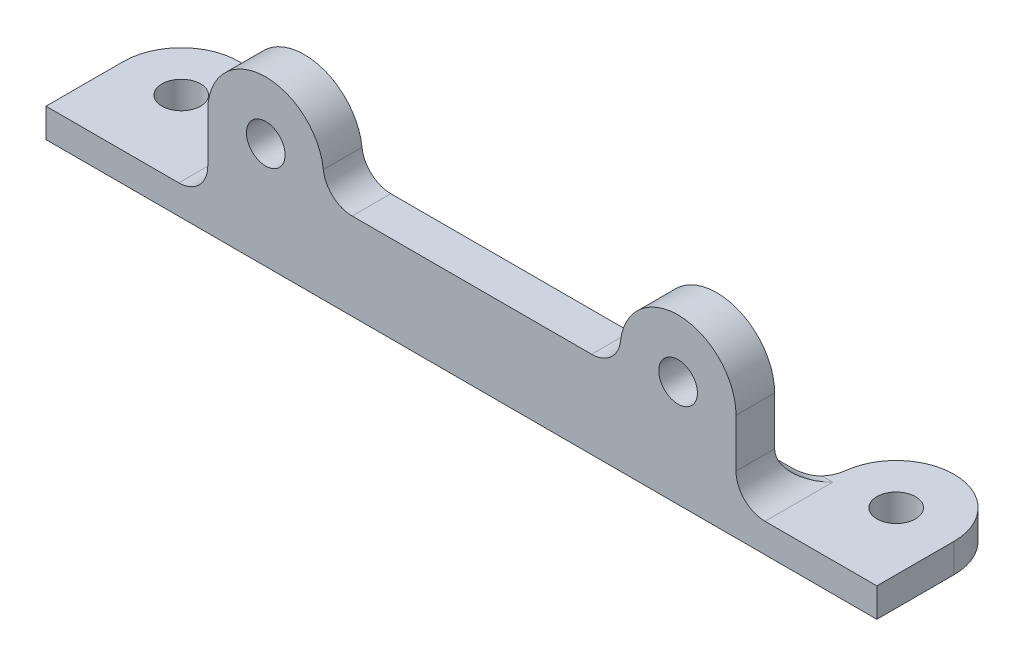
ISO-10303-21;
HEADER;
FILE_DESCRIPTION(('STEP AP214'),'2;1');
FILE_NAME('part.step','',(''),(''),'','','');
FILE_SCHEMA(('AUTOMOTIVE_DESIGN { 1 0 10303 214 1 1 1 1 }'));
ENDSEC;
DATA;
#1=APPLICATION_CONTEXT('core data for automotive mechanical design processes');
#2=APPLICATION_PROTOCOL_DEFINITION('international standard','automotive_design',2000,#1);
#3=PRODUCT_CONTEXT('',#1,'mechanical');
#4=PRODUCT('Part','Part','',(#3));
#5=PRODUCT_RELATED_PRODUCT_CATEGORY('part','',(#4));
#6=PRODUCT_DEFINITION_FORMATION('','',#4);
#7=PRODUCT_DEFINITION_CONTEXT('part definition',#1,'design');
#8=PRODUCT_DEFINITION('design','',#6,#7);
#9=PRODUCT_DEFINITION_SHAPE('','',#8);
#10=(LENGTH_UNIT() NAMED_UNIT(*) SI_UNIT(.MILLI.,.METRE.));
#11=(NAMED_UNIT(*) PLANE_ANGLE_UNIT() SI_UNIT($,.RADIAN.));
#12=(NAMED_UNIT(*) SI_UNIT($,.STERADIAN.) SOLID_ANGLE_UNIT());
#13=UNCERTAINTY_MEASURE_WITH_UNIT(LENGTH_MEASURE(1.E-05),#10,'distance_accuracy_value','');
#14=(GEOMETRIC_REPRESENTATION_CONTEXT(3) GLOBAL_UNCERTAINTY_ASSIGNED_CONTEXT((#13)) GLOBAL_UNIT_ASSIGNED_CONTEXT((#10,
#11,#12)) REPRESENTATION_CONTEXT('',''));
#15=CARTESIAN_POINT('',(0.,0.,0.));
#16=DIRECTION('',(0.,0.,1.));
#17=DIRECTION('',(1.,0.,0.));
#18=AXIS2_PLACEMENT_3D('',#15,#16,#17);
#19=CARTESIAN_POINT('',(0.,6.,1.));
#20=DIRECTION('',(-1.,0.,0.));
#21=DIRECTION('',(0.,0.,1.));
#22=AXIS2_PLACEMENT_3D('',#19,#20,#21);
#23=CYLINDRICAL_SURFACE('',#22,3.);
#24=DIRECTION('',(-1.,0.,0.));
#25=VECTOR('',#24,1.);
#26=CARTESIAN_POINT('',(0.,3.,1.));
#27=LINE('',#26,#25);
#28=CARTESIAN_POINT('',(67.2917960675006,3.,1.));
#29=VERTEX_POINT('',#28);
#30=CARTESIAN_POINT('',(68.4242365283552,3.,1.));
#31=VERTEX_POINT('',#30);
#32=EDGE_CURVE('E291',#29,#31,#27,.F.);
#33=ORIENTED_EDGE('',*,*,#32,.F.);
#34=CARTESIAN_POINT('',(67.2917960675006,3.,1.));
#35=CARTESIAN_POINT('',(67.2364548727916,3.00000044074267,1.06188946641905));
#36=CARTESIAN_POINT('',(67.178556455534,3.00191474656417,1.12143671954915));
#37=CARTESIAN_POINT('',(67.0581660588117,3.00870672524174,1.23541738653473));
#38=CARTESIAN_POINT('',(66.9956776693219,3.01358210338594,1.28985472269132));
#39=CARTESIAN_POINT('',(66.8665387317685,3.02543474745615,1.39328501088777));
#40=CARTESIAN_POINT('',(66.7998880326978,3.03241208967588,1.44227776522055));
#41=CARTESIAN_POINT('',(66.6628826879758,3.04763589975376,1.53453756703246));
#42=CARTESIAN_POINT('',(66.592527406496,3.05588258594341,1.57780362711487));
#43=CARTESIAN_POINT('',(66.3768124377782,3.0812862899577,1.69848479150016));
#44=CARTESIAN_POINT('',(66.2264638343451,3.099146164623,1.76705411985068));
#45=CARTESIAN_POINT('',(65.9164317708158,3.13094326752467,1.87858614767298));
#46=CARTESIAN_POINT('',(65.7567658910774,3.14488761207814,1.9215954624267));
#47=CARTESIAN_POINT('',(65.5057816241248,3.16021704010705,1.96742376632034));
#48=CARTESIAN_POINT('',(65.4162688378073,3.16442996175495,1.97962310877027));
#49=CARTESIAN_POINT('',(65.2364293858268,3.17012665435029,1.99591511378764));
#50=CARTESIAN_POINT('',(65.1461027653807,3.17161057599374,2.00000822398407));
#51=CARTESIAN_POINT('',(65.0557280900008,3.17157287525381,2.));
#52=B_SPLINE_CURVE_WITH_KNOTS('',3,(#34,#35,#36,#37,#38,#39,#40,#41,#42,#43,#44,#45,#46,#47,#48,
#49,#50,#51),.UNSPECIFIED.,.F.,.F.,(4,2,2,2,2,2,2,2,4),(0.,0.248917701740481,0.497642747979507,
0.746376823129656,0.995153729300597,1.49141381632357,1.98676604521497,2.25770982706082,
2.52863864687878),.UNSPECIFIED.);
#53=CARTESIAN_POINT('',(65.0557280900008,3.17157287525381,2.));
#54=VERTEX_POINT('',#53);
#55=EDGE_CURVE('E330',#29,#54,#52,.T.);
#56=ORIENTED_EDGE('',*,*,#55,.T.);
#57=DIRECTION('',(-1.,0.,0.));
#58=VECTOR('',#57,1.);
#59=CARTESIAN_POINT('',(8.74596283490439,3.17157287525381,2.));
#60=LINE('',#59,#58);
#61=CARTESIAN_POINT('',(8.94427190999916,3.17157287525381,2.));
#62=VERTEX_POINT('',#61);
#63=EDGE_CURVE('E314',#62,#54,#60,.F.);
#64=ORIENTED_EDGE('',*,*,#63,.F.);
#65=CARTESIAN_POINT('',(8.94427190999916,3.17157287525381,2.));
#66=CARTESIAN_POINT('',(8.91000259856074,3.17157146458319,1.9999994860485));
#67=CARTESIAN_POINT('',(8.87575585167595,3.17136427828106,1.99941289416738));
#68=CARTESIAN_POINT('',(8.80730748702373,3.1705383544139,1.99706755454629));
#69=CARTESIAN_POINT('',(8.77310586925629,3.169919616849,1.99530880680665));
#70=CARTESIAN_POINT('',(8.73892681604247,3.16909510365271,1.99296398113775));
#71=B_SPLINE_CURVE_WITH_KNOTS('',3,(#65,#66,#67,#68,#69,#70),.UNSPECIFIED.,.F.,.F.,(4,2,4),(0.,
0.102757190480811,0.205514380931217),.UNSPECIFIED.);
#72=CARTESIAN_POINT('',(8.73892681604244,3.16909510365281,1.99296398113805));
#73=VERTEX_POINT('',#72);
#74=EDGE_CURVE('E357',#62,#73,#71,.T.);
#75=ORIENTED_EDGE('',*,*,#74,.T.);
#76=CARTESIAN_POINT('',(7.74596283490439,6.,1.));
#77=DIRECTION('',(0.707106781186547,0.,-0.707106781186547));
#78=DIRECTION('',(-0.707106781186547,0.,-0.707106781186547));
#79=AXIS2_PLACEMENT_3D('',#76,#77,#78);
#80=ELLIPSE('',#79,4.24264068711928,3.);
#81=CARTESIAN_POINT('',(10.7459628349044,6.,4.));
#82=VERTEX_POINT('',#81);
#83=EDGE_CURVE('E59',#73,#82,#80,.F.);
#84=ORIENTED_EDGE('',*,*,#83,.T.);
#85=DIRECTION('',(-1.,0.,0.));
#86=VECTOR('',#85,1.);
#87=CARTESIAN_POINT('',(0.,6.,4.));
#88=LINE('',#87,#86);
#89=CARTESIAN_POINT('',(65.4242365283552,6.,4.));
#90=VERTEX_POINT('',#89);
#91=EDGE_CURVE('E301',#90,#82,#88,.T.);
#92=ORIENTED_EDGE('',*,*,#91,.F.);
#93=CARTESIAN_POINT('',(68.4242365283552,6.,1.));
#94=DIRECTION('',(-0.707106781186547,0.,-0.707106781186547));
#95=DIRECTION('',(-0.707106781186547,0.,0.707106781186547));
#96=AXIS2_PLACEMENT_3D('',#93,#94,#95);
#97=ELLIPSE('',#96,4.24264068711928,3.);
#98=EDGE_CURVE('E317',#31,#90,#97,.T.);
#99=ORIENTED_EDGE('',*,*,#98,.F.);
#100=EDGE_LOOP('',(#33,#56,#64,#75,#84,#92,#99));
#101=FACE_BOUND('',#100,.T.);
#102=ADVANCED_FACE('F37',(#101),#23,.F.);
#103=CARTESIAN_POINT('',(0.,3.,0.));
#104=DIRECTION('',(0.,1.,0.));
#105=DIRECTION('',(0.,0.,1.));
#106=AXIS2_PLACEMENT_3D('',#103,#104,#105);
#107=PLANE('',#106);
#108=CARTESIAN_POINT('',(0.,3.,0.));
#109=DIRECTION('',(0.,1.,0.));
#110=DIRECTION('',(0.,0.,1.));
#111=AXIS2_PLACEMENT_3D('',#108,#109,#110);
#112=CIRCLE('',#111,2.);
#113=CARTESIAN_POINT('',(0.,3.,2.));
#114=VERTEX_POINT('',#113);
#115=EDGE_CURVE('E249',#114,#114,#112,.T.);
#116=ORIENTED_EDGE('',*,*,#115,.F.);
#117=EDGE_LOOP('',(#116));
#118=FACE_BOUND('',#117,.T.);
#119=DIRECTION('',(1.,0.,0.));
#120=VECTOR('',#119,1.);
#121=CARTESIAN_POINT('',(0.,3.,8.));
#122=LINE('',#121,#120);
#123=CARTESIAN_POINT('',(-6.,3.,8.));
#124=VERTEX_POINT('',#123);
#125=CARTESIAN_POINT('',(7.74596283490439,3.,8.));
#126=VERTEX_POINT('',#125);
#127=EDGE_CURVE('E241',#124,#126,#122,.T.);
#128=ORIENTED_EDGE('',*,*,#127,.T.);
#129=DIRECTION('',(0.,0.,1.));
#130=VECTOR('',#129,1.);
#131=CARTESIAN_POINT('',(7.74596283490439,3.,4.));
#132=LINE('',#131,#130);
#133=CARTESIAN_POINT('',(7.74596283490439,3.,1.75028277828763));
#134=VERTEX_POINT('',#133);
#135=EDGE_CURVE('E52',#126,#134,#132,.F.);
#136=ORIENTED_EDGE('',*,*,#135,.T.);
#137=CARTESIAN_POINT('',(8.94427190999916,3.,-1.));
#138=DIRECTION('',(0.,1.,0.));
#139=DIRECTION('',(0.,0.,1.));
#140=AXIS2_PLACEMENT_3D('',#137,#138,#139);
#141=CIRCLE('',#140,3.);
#142=CARTESIAN_POINT('',(5.96284793999944,3.,-0.666666666666667));
#143=VERTEX_POINT('',#142);
#144=EDGE_CURVE('E11',#134,#143,#141,.F.);
#145=ORIENTED_EDGE('',*,*,#144,.T.);
#146=CARTESIAN_POINT('',(0.,3.,0.));
#147=DIRECTION('',(0.,1.,0.));
#148=DIRECTION('',(0.,0.,1.));
#149=AXIS2_PLACEMENT_3D('',#146,#147,#148);
#150=CIRCLE('',#149,6.);
#151=CARTESIAN_POINT('',(-6.,3.,0.));
#152=VERTEX_POINT('',#151);
#153=EDGE_CURVE('E235',#143,#152,#150,.T.);
#154=ORIENTED_EDGE('',*,*,#153,.T.);
#155=DIRECTION('',(0.,0.,1.));
#156=VECTOR('',#155,1.);
#157=CARTESIAN_POINT('',(-6.,3.,0.));
#158=LINE('',#157,#156);
#159=EDGE_CURVE('E238',#152,#124,#158,.T.);
#160=ORIENTED_EDGE('',*,*,#159,.T.);
#161=EDGE_LOOP('',(#128,#136,#145,#154,#160));
#162=FACE_BOUND('',#161,.T.);
#163=ADVANCED_FACE('F388',(#118,#162),#107,.T.);
#164=CARTESIAN_POINT('',(0.,3.,0.));
#165=DIRECTION('',(0.,-1.,0.));
#166=DIRECTION('',(0.,0.,-1.));
#167=AXIS2_PLACEMENT_3D('',#164,#165,#166);
#168=CYLINDRICAL_SURFACE('',#167,6.);
#169=ORIENTED_EDGE('',*,*,#153,.F.);
#170=DIRECTION('',(0.,-1.,0.));
#171=VECTOR('',#170,1.);
#172=CARTESIAN_POINT('',(5.96284793999944,3.,-0.666666666666667));
#173=LINE('',#172,#171);
#174=CARTESIAN_POINT('',(5.96284793999944,0.,-0.666666666666667));
#175=VERTEX_POINT('',#174);
#176=EDGE_CURVE('E338',#143,#175,#173,.T.);
#177=ORIENTED_EDGE('',*,*,#176,.T.);
#178=CARTESIAN_POINT('',(0.,0.,0.));
#179=DIRECTION('',(0.,1.,0.));
#180=DIRECTION('',(0.,0.,1.));
#181=AXIS2_PLACEMENT_3D('',#178,#179,#180);
#182=CIRCLE('',#181,6.);
#183=CARTESIAN_POINT('',(-6.,0.,0.));
#184=VERTEX_POINT('',#183);
#185=EDGE_CURVE('E255',#175,#184,#182,.T.);
#186=ORIENTED_EDGE('',*,*,#185,.T.);
#187=DIRECTION('',(0.,-1.,0.));
#188=VECTOR('',#187,1.);
#189=CARTESIAN_POINT('',(-6.,3.,0.));
#190=LINE('',#189,#188);
#191=EDGE_CURVE('E279',#152,#184,#190,.T.);
#192=ORIENTED_EDGE('',*,*,#191,.F.);
#193=EDGE_LOOP('',(#169,#177,#186,#192));
#194=FACE_BOUND('',#193,.T.);
#195=ADVANCED_FACE('F373',(#194),#168,.T.);
#196=CARTESIAN_POINT('',(-6.,3.,0.));
#197=DIRECTION('',(1.,0.,0.));
#198=DIRECTION('',(0.,0.,-1.));
#199=AXIS2_PLACEMENT_3D('',#196,#197,#198);
#200=PLANE('',#199);
#201=DIRECTION('',(0.,0.,1.));
#202=VECTOR('',#201,1.);
#203=CARTESIAN_POINT('',(-6.,0.,0.));
#204=LINE('',#203,#202);
#205=CARTESIAN_POINT('',(-6.,0.,8.));
#206=VERTEX_POINT('',#205);
#207=EDGE_CURVE('E257',#184,#206,#204,.T.);
#208=ORIENTED_EDGE('',*,*,#207,.T.);
#209=DIRECTION('',(0.,-1.,0.));
#210=VECTOR('',#209,1.);
#211=CARTESIAN_POINT('',(-6.,3.,8.));
#212=LINE('',#211,#210);
#213=EDGE_CURVE('E276',#124,#206,#212,.T.);
#214=ORIENTED_EDGE('',*,*,#213,.F.);
#215=ORIENTED_EDGE('',*,*,#159,.F.);
#216=ORIENTED_EDGE('',*,*,#191,.T.);
#217=EDGE_LOOP('',(#208,#214,#215,#216));
#218=FACE_BOUND('',#217,.T.);
#219=ADVANCED_FACE('F386',(#218),#200,.F.);
#220=CARTESIAN_POINT('',(0.,3.,8.));
#221=DIRECTION('',(0.,0.,-1.));
#222=DIRECTION('',(-1.,0.,0.));
#223=AXIS2_PLACEMENT_3D('',#220,#221,#222);
#224=PLANE('',#223);
#225=DIRECTION('',(1.,0.,0.));
#226=VECTOR('',#225,1.);
#227=CARTESIAN_POINT('',(0.,0.,8.));
#228=LINE('',#227,#226);
#229=CARTESIAN_POINT('',(80.,0.,8.));
#230=VERTEX_POINT('',#229);
#231=EDGE_CURVE('E259',#206,#230,#228,.T.);
#232=ORIENTED_EDGE('',*,*,#231,.T.);
#233=DIRECTION('',(0.,-1.,0.));
#234=VECTOR('',#233,1.);
#235=CARTESIAN_POINT('',(80.,3.,8.));
#236=LINE('',#235,#234);
#237=CARTESIAN_POINT('',(80.,3.,8.));
#238=VERTEX_POINT('',#237);
#239=EDGE_CURVE('E274',#238,#230,#236,.T.);
#240=ORIENTED_EDGE('',*,*,#239,.F.);
#241=CARTESIAN_POINT('',(68.4242365283552,3.,8.));
#242=VERTEX_POINT('',#241);
#243=EDGE_CURVE('E240',#242,#238,#122,.T.);
#244=ORIENTED_EDGE('',*,*,#243,.F.);
#245=CARTESIAN_POINT('',(68.4242365283552,6.,8.));
#246=DIRECTION('',(0.,0.,-1.));
#247=DIRECTION('',(-1.,0.,0.));
#248=AXIS2_PLACEMENT_3D('',#245,#246,#247);
#249=CIRCLE('',#248,3.);
#250=CARTESIAN_POINT('',(65.4242365283552,6.,8.));
#251=VERTEX_POINT('',#250);
#252=EDGE_CURVE('E310',#242,#251,#249,.T.);
#253=ORIENTED_EDGE('',*,*,#252,.T.);
#254=DIRECTION('',(0.,-1.,0.));
#255=VECTOR('',#254,1.);
#256=CARTESIAN_POINT('',(65.4242365283552,0.,8.));
#257=LINE('',#256,#255);
#258=CARTESIAN_POINT('',(65.4242365283552,11.,8.));
#259=VERTEX_POINT('',#258);
#260=EDGE_CURVE('E213',#259,#251,#257,.T.);
#261=ORIENTED_EDGE('',*,*,#260,.F.);
#262=CARTESIAN_POINT('',(59.4242365283552,11.,8.));
#263=DIRECTION('',(0.,0.,1.));
#264=DIRECTION('',(1.,0.,0.));
#265=AXIS2_PLACEMENT_3D('',#262,#263,#264);
#266=CIRCLE('',#265,5.99999999999999);
#267=CARTESIAN_POINT('',(53.4613885883558,11.6666666666667,8.));
#268=VERTEX_POINT('',#267);
#269=EDGE_CURVE('E178',#259,#268,#266,.T.);
#270=ORIENTED_EDGE('',*,*,#269,.T.);
#271=CARTESIAN_POINT('',(50.479964618356,12.,8.));
#272=DIRECTION('',(0.,0.,-1.));
#273=DIRECTION('',(-1.,0.,0.));
#274=AXIS2_PLACEMENT_3D('',#271,#272,#273);
#275=CIRCLE('',#274,3.);
#276=CARTESIAN_POINT('',(50.479964618356,9.,8.));
#277=VERTEX_POINT('',#276);
#278=EDGE_CURVE('E307',#268,#277,#275,.T.);
#279=ORIENTED_EDGE('',*,*,#278,.T.);
#280=DIRECTION('',(1.,0.,0.));
#281=VECTOR('',#280,1.);
#282=CARTESIAN_POINT('',(0.,9.,8.));
#283=LINE('',#282,#281);
#284=CARTESIAN_POINT('',(25.6902347449035,9.,8.));
#285=VERTEX_POINT('',#284);
#286=EDGE_CURVE('E216',#285,#277,#283,.T.);
#287=ORIENTED_EDGE('',*,*,#286,.F.);
#288=CARTESIAN_POINT('',(25.6902347449035,12.,8.));
#289=DIRECTION('',(0.,0.,-1.));
#290=DIRECTION('',(-1.,0.,0.));
#291=AXIS2_PLACEMENT_3D('',#288,#289,#290);
#292=CIRCLE('',#291,3.);
#293=CARTESIAN_POINT('',(22.7088107749038,11.6666666666667,8.));
#294=VERTEX_POINT('',#293);
#295=EDGE_CURVE('E303',#285,#294,#292,.T.);
#296=ORIENTED_EDGE('',*,*,#295,.T.);
#297=CARTESIAN_POINT('',(16.7459628349044,11.,8.));
#298=DIRECTION('',(0.,0.,1.));
#299=DIRECTION('',(1.,0.,0.));
#300=AXIS2_PLACEMENT_3D('',#297,#298,#299);
#301=CIRCLE('',#300,6.);
#302=CARTESIAN_POINT('',(10.7459628349044,11.,8.));
#303=VERTEX_POINT('',#302);
#304=EDGE_CURVE('E219',#294,#303,#301,.T.);
#305=ORIENTED_EDGE('',*,*,#304,.T.);
#306=DIRECTION('',(0.,-1.,0.));
#307=VECTOR('',#306,1.);
#308=CARTESIAN_POINT('',(10.7459628349044,0.,8.));
#309=LINE('',#308,#307);
#310=CARTESIAN_POINT('',(10.7459628349044,6.,8.));
#311=VERTEX_POINT('',#310);
#312=EDGE_CURVE('E221',#303,#311,#309,.T.);
#313=ORIENTED_EDGE('',*,*,#312,.T.);
#314=CARTESIAN_POINT('',(7.74596283490439,6.,8.));
#315=DIRECTION('',(0.,0.,-1.));
#316=DIRECTION('',(-1.,0.,0.));
#317=AXIS2_PLACEMENT_3D('',#314,#315,#316);
#318=CIRCLE('',#317,3.);
#319=EDGE_CURVE('E312',#311,#126,#318,.T.);
#320=ORIENTED_EDGE('',*,*,#319,.T.);
#321=ORIENTED_EDGE('',*,*,#127,.F.);
#322=ORIENTED_EDGE('',*,*,#213,.T.);
#323=EDGE_LOOP('',(#232,#240,#244,#253,#261,#270,#279,#287,#296,#305,#313,#320,#321,#322));
#324=FACE_BOUND('',#323,.T.);
#325=CARTESIAN_POINT('',(16.7459628349044,11.,8.));
#326=DIRECTION('',(0.,0.,1.));
#327=DIRECTION('',(1.,0.,0.));
#328=AXIS2_PLACEMENT_3D('',#325,#326,#327);
#329=CIRCLE('',#328,2.);
#330=CARTESIAN_POINT('',(18.7459628349044,11.,8.));
#331=VERTEX_POINT('',#330);
#332=EDGE_CURVE('E224',#331,#331,#329,.T.);
#333=ORIENTED_EDGE('',*,*,#332,.F.);
#334=EDGE_LOOP('',(#333));
#335=FACE_BOUND('',#334,.T.);
#336=CARTESIAN_POINT('',(59.4242365283552,11.,8.));
#337=DIRECTION('',(0.,0.,1.));
#338=DIRECTION('',(1.,0.,0.));
#339=AXIS2_PLACEMENT_3D('',#336,#337,#338);
#340=CIRCLE('',#339,2.);
#341=CARTESIAN_POINT('',(61.4242365283552,11.,8.));
#342=VERTEX_POINT('',#341);
#343=EDGE_CURVE('E192',#342,#342,#340,.T.);
#344=ORIENTED_EDGE('',*,*,#343,.F.);
#345=EDGE_LOOP('',(#344));
#346=FACE_BOUND('',#345,.T.);
#347=ADVANCED_FACE('F393',(#324,#335,#346),#224,.F.);
#348=CARTESIAN_POINT('',(80.,3.,0.));
#349=DIRECTION('',(1.,0.,0.));
#350=DIRECTION('',(0.,0.,-1.));
#351=AXIS2_PLACEMENT_3D('',#348,#349,#350);
#352=PLANE('',#351);
#353=DIRECTION('',(0.,0.,1.));
#354=VECTOR('',#353,1.);
#355=CARTESIAN_POINT('',(80.,0.,0.));
#356=LINE('',#355,#354);
#357=CARTESIAN_POINT('',(80.,0.,0.));
#358=VERTEX_POINT('',#357);
#359=EDGE_CURVE('E262',#358,#230,#356,.T.);
#360=ORIENTED_EDGE('',*,*,#359,.F.);
#361=DIRECTION('',(0.,-1.,0.));
#362=VECTOR('',#361,1.);
#363=CARTESIAN_POINT('',(80.,3.,0.));
#364=LINE('',#363,#362);
#365=CARTESIAN_POINT('',(80.,3.,0.));
#366=VERTEX_POINT('',#365);
#367=EDGE_CURVE('E252',#366,#358,#364,.T.);
#368=ORIENTED_EDGE('',*,*,#367,.F.);
#369=DIRECTION('',(0.,0.,1.));
#370=VECTOR('',#369,1.);
#371=CARTESIAN_POINT('',(80.,3.,0.));
#372=LINE('',#371,#370);
#373=EDGE_CURVE('E243',#366,#238,#372,.T.);
#374=ORIENTED_EDGE('',*,*,#373,.T.);
#375=ORIENTED_EDGE('',*,*,#239,.T.);
#376=EDGE_LOOP('',(#360,#368,#374,#375));
#377=FACE_BOUND('',#376,.T.);
#378=ADVANCED_FACE('F414',(#377),#352,.T.);
#379=CARTESIAN_POINT('',(74.,3.,0.));
#380=DIRECTION('',(0.,-1.,0.));
#381=DIRECTION('',(0.,0.,-1.));
#382=AXIS2_PLACEMENT_3D('',#379,#380,#381);
#383=CYLINDRICAL_SURFACE('',#382,6.);
#384=CARTESIAN_POINT('',(74.,0.,0.));
#385=DIRECTION('',(0.,1.,0.));
#386=DIRECTION('',(0.,0.,1.));
#387=AXIS2_PLACEMENT_3D('',#384,#385,#386);
#388=CIRCLE('',#387,6.);
#389=CARTESIAN_POINT('',(68.0371520600006,0.,-0.666666666666668));
#390=VERTEX_POINT('',#389);
#391=EDGE_CURVE('E265',#358,#390,#388,.T.);
#392=ORIENTED_EDGE('',*,*,#391,.T.);
#393=DIRECTION('',(0.,-1.,0.));
#394=VECTOR('',#393,1.);
#395=CARTESIAN_POINT('',(68.0371520600006,3.,-0.666666666666668));
#396=LINE('',#395,#394);
#397=CARTESIAN_POINT('',(68.0371520600006,3.,-0.666666666666668));
#398=VERTEX_POINT('',#397);
#399=EDGE_CURVE('E323',#390,#398,#396,.F.);
#400=ORIENTED_EDGE('',*,*,#399,.T.);
#401=CARTESIAN_POINT('',(74.,3.,0.));
#402=DIRECTION('',(0.,1.,0.));
#403=DIRECTION('',(0.,0.,1.));
#404=AXIS2_PLACEMENT_3D('',#401,#402,#403);
#405=CIRCLE('',#404,6.);
#406=EDGE_CURVE('E246',#366,#398,#405,.T.);
#407=ORIENTED_EDGE('',*,*,#406,.F.);
#408=ORIENTED_EDGE('',*,*,#367,.T.);
#409=EDGE_LOOP('',(#392,#400,#407,#408));
#410=FACE_BOUND('',#409,.T.);
#411=ADVANCED_FACE('F423',(#410),#383,.T.);
#412=CARTESIAN_POINT('',(0.,3.,2.));
#413=DIRECTION('',(0.,0.,1.));
#414=DIRECTION('',(1.,0.,0.));
#415=AXIS2_PLACEMENT_3D('',#412,#413,#414);
#416=PLANE('',#415);
#417=DIRECTION('',(-1.,0.,0.));
#418=VECTOR('',#417,1.);
#419=CARTESIAN_POINT('',(0.,0.,2.));
#420=LINE('',#419,#418);
#421=CARTESIAN_POINT('',(65.0557280900008,0.,2.));
#422=VERTEX_POINT('',#421);
#423=CARTESIAN_POINT('',(8.94427190999916,0.,2.));
#424=VERTEX_POINT('',#423);
#425=EDGE_CURVE('E268',#422,#424,#420,.T.);
#426=ORIENTED_EDGE('',*,*,#425,.T.);
#427=DIRECTION('',(0.,1.,0.));
#428=VECTOR('',#427,1.);
#429=CARTESIAN_POINT('',(8.94427190999916,3.,2.));
#430=LINE('',#429,#428);
#431=EDGE_CURVE('E364',#424,#62,#430,.T.);
#432=ORIENTED_EDGE('',*,*,#431,.T.);
#433=ORIENTED_EDGE('',*,*,#63,.T.);
#434=DIRECTION('',(0.,1.,0.));
#435=VECTOR('',#434,1.);
#436=CARTESIAN_POINT('',(65.0557280900008,0.,2.));
#437=LINE('',#436,#435);
#438=EDGE_CURVE('E316',#54,#422,#437,.F.);
#439=ORIENTED_EDGE('',*,*,#438,.T.);
#440=EDGE_LOOP('',(#426,#432,#433,#439));
#441=FACE_BOUND('',#440,.T.);
#442=ADVANCED_FACE('F421',(#441),#416,.F.);
#443=CARTESIAN_POINT('',(74.,3.,0.));
#444=DIRECTION('',(0.,-1.,0.));
#445=DIRECTION('',(0.,0.,-1.));
#446=AXIS2_PLACEMENT_3D('',#443,#444,#445);
#447=CYLINDRICAL_SURFACE('',#446,2.);
#448=CARTESIAN_POINT('',(74.,3.,0.));
#449=DIRECTION('',(0.,1.,0.));
#450=DIRECTION('',(0.,0.,1.));
#451=AXIS2_PLACEMENT_3D('',#448,#449,#450);
#452=CIRCLE('',#451,2.);
#453=CARTESIAN_POINT('',(74.,3.,2.));
#454=VERTEX_POINT('',#453);
#455=EDGE_CURVE('E232',#454,#454,#452,.T.);
#456=ORIENTED_EDGE('',*,*,#455,.T.);
#457=EDGE_LOOP('',(#456));
#458=FACE_BOUND('',#457,.T.);
#459=CARTESIAN_POINT('',(74.,0.,0.));
#460=DIRECTION('',(0.,1.,0.));
#461=DIRECTION('',(0.,0.,1.));
#462=AXIS2_PLACEMENT_3D('',#459,#460,#461);
#463=CIRCLE('',#462,2.);
#464=CARTESIAN_POINT('',(74.,0.,2.));
#465=VERTEX_POINT('',#464);
#466=EDGE_CURVE('E230',#465,#465,#463,.T.);
#467=ORIENTED_EDGE('',*,*,#466,.F.);
#468=EDGE_LOOP('',(#467));
#469=FACE_BOUND('',#468,.T.);
#470=ADVANCED_FACE('F430',(#458,#469),#447,.F.);
#471=CARTESIAN_POINT('',(0.,3.,0.));
#472=DIRECTION('',(0.,-1.,0.));
#473=DIRECTION('',(0.,0.,-1.));
#474=AXIS2_PLACEMENT_3D('',#471,#472,#473);
#475=CYLINDRICAL_SURFACE('',#474,2.);
#476=ORIENTED_EDGE('',*,*,#115,.T.);
#477=EDGE_LOOP('',(#476));
#478=FACE_BOUND('',#477,.T.);
#479=CARTESIAN_POINT('',(0.,0.,0.));
#480=DIRECTION('',(0.,1.,0.));
#481=DIRECTION('',(0.,0.,1.));
#482=AXIS2_PLACEMENT_3D('',#479,#480,#481);
#483=CIRCLE('',#482,2.);
#484=CARTESIAN_POINT('',(0.,0.,2.));
#485=VERTEX_POINT('',#484);
#486=EDGE_CURVE('E236',#485,#485,#483,.T.);
#487=ORIENTED_EDGE('',*,*,#486,.F.);
#488=EDGE_LOOP('',(#487));
#489=FACE_BOUND('',#488,.T.);
#490=ADVANCED_FACE('F447',(#478,#489),#475,.F.);
#491=ORIENTED_EDGE('',*,*,#32,.T.);
#492=DIRECTION('',(0.,0.,1.));
#493=VECTOR('',#492,1.);
#494=CARTESIAN_POINT('',(68.4242365283552,3.,0.));
#495=LINE('',#494,#493);
#496=EDGE_CURVE('E294',#31,#242,#495,.T.);
#497=ORIENTED_EDGE('',*,*,#496,.T.);
#498=ORIENTED_EDGE('',*,*,#243,.T.);
#499=ORIENTED_EDGE('',*,*,#373,.F.);
#500=ORIENTED_EDGE('',*,*,#406,.T.);
#501=CARTESIAN_POINT('',(65.0557280900008,3.,-1.));
#502=DIRECTION('',(0.,1.,0.));
#503=DIRECTION('',(0.,0.,1.));
#504=AXIS2_PLACEMENT_3D('',#501,#502,#503);
#505=CIRCLE('',#504,3.);
#506=EDGE_CURVE('E327',#398,#29,#505,.F.);
#507=ORIENTED_EDGE('',*,*,#506,.T.);
#508=EDGE_LOOP('',(#491,#497,#498,#499,#500,#507));
#509=FACE_BOUND('',#508,.T.);
#510=ORIENTED_EDGE('',*,*,#455,.F.);
#511=EDGE_LOOP('',(#510));
#512=FACE_BOUND('',#511,.T.);
#513=ADVANCED_FACE('F408',(#509,#512),#107,.T.);
#514=CARTESIAN_POINT('',(0.,0.,0.));
#515=DIRECTION('',(0.,1.,0.));
#516=DIRECTION('',(0.,0.,1.));
#517=AXIS2_PLACEMENT_3D('',#514,#515,#516);
#518=PLANE('',#517);
#519=ORIENTED_EDGE('',*,*,#466,.T.);
#520=EDGE_LOOP('',(#519));
#521=FACE_BOUND('',#520,.T.);
#522=ORIENTED_EDGE('',*,*,#185,.F.);
#523=CARTESIAN_POINT('',(8.94427190999916,0.,-1.));
#524=DIRECTION('',(0.,1.,0.));
#525=DIRECTION('',(0.,0.,1.));
#526=AXIS2_PLACEMENT_3D('',#523,#524,#525);
#527=CIRCLE('',#526,3.);
#528=EDGE_CURVE('E363',#175,#424,#527,.T.);
#529=ORIENTED_EDGE('',*,*,#528,.T.);
#530=ORIENTED_EDGE('',*,*,#425,.F.);
#531=CARTESIAN_POINT('',(65.0557280900008,0.,-1.));
#532=DIRECTION('',(0.,1.,0.));
#533=DIRECTION('',(0.,0.,1.));
#534=AXIS2_PLACEMENT_3D('',#531,#532,#533);
#535=CIRCLE('',#534,3.);
#536=EDGE_CURVE('E325',#422,#390,#535,.T.);
#537=ORIENTED_EDGE('',*,*,#536,.T.);
#538=ORIENTED_EDGE('',*,*,#391,.F.);
#539=ORIENTED_EDGE('',*,*,#359,.T.);
#540=ORIENTED_EDGE('',*,*,#231,.F.);
#541=ORIENTED_EDGE('',*,*,#207,.F.);
#542=EDGE_LOOP('',(#522,#529,#530,#537,#538,#539,#540,#541));
#543=FACE_BOUND('',#542,.T.);
#544=ORIENTED_EDGE('',*,*,#486,.T.);
#545=EDGE_LOOP('',(#544));
#546=FACE_BOUND('',#545,.T.);
#547=ADVANCED_FACE('F379',(#521,#543,#546),#518,.F.);
#548=CARTESIAN_POINT('',(10.7459628349044,0.,4.));
#549=DIRECTION('',(-1.,0.,0.));
#550=DIRECTION('',(0.,0.,1.));
#551=AXIS2_PLACEMENT_3D('',#548,#549,#550);
#552=PLANE('',#551);
#553=DIRECTION('',(0.,-1.,0.));
#554=VECTOR('',#553,1.);
#555=CARTESIAN_POINT('',(10.7459628349044,0.,4.));
#556=LINE('',#555,#554);
#557=CARTESIAN_POINT('',(10.7459628349044,11.,4.));
#558=VERTEX_POINT('',#557);
#559=EDGE_CURVE('E205',#558,#82,#556,.T.);
#560=ORIENTED_EDGE('',*,*,#559,.T.);
#561=DIRECTION('',(0.,0.,1.));
#562=VECTOR('',#561,1.);
#563=CARTESIAN_POINT('',(10.7459628349044,6.,8.));
#564=LINE('',#563,#562);
#565=EDGE_CURVE('E299',#82,#311,#564,.T.);
#566=ORIENTED_EDGE('',*,*,#565,.T.);
#567=ORIENTED_EDGE('',*,*,#312,.F.);
#568=DIRECTION('',(0.,0.,1.));
#569=VECTOR('',#568,1.);
#570=CARTESIAN_POINT('',(10.7459628349044,11.,4.));
#571=LINE('',#570,#569);
#572=EDGE_CURVE('E182',#558,#303,#571,.T.);
#573=ORIENTED_EDGE('',*,*,#572,.F.);
#574=EDGE_LOOP('',(#560,#566,#567,#573));
#575=FACE_BOUND('',#574,.T.);
#576=ADVANCED_FACE('F399',(#575),#552,.T.);
#577=CARTESIAN_POINT('',(16.7459628349044,11.,4.));
#578=DIRECTION('',(0.,0.,1.));
#579=DIRECTION('',(1.,0.,0.));
#580=AXIS2_PLACEMENT_3D('',#577,#578,#579);
#581=CYLINDRICAL_SURFACE('',#580,6.);
#582=ORIENTED_EDGE('',*,*,#304,.F.);
#583=DIRECTION('',(0.,0.,1.));
#584=VECTOR('',#583,1.);
#585=CARTESIAN_POINT('',(22.7088107749038,11.6666666666667,4.));
#586=LINE('',#585,#584);
#587=CARTESIAN_POINT('',(22.7088107749038,11.6666666666667,4.));
#588=VERTEX_POINT('',#587);
#589=EDGE_CURVE('E287',#294,#588,#586,.F.);
#590=ORIENTED_EDGE('',*,*,#589,.T.);
#591=CARTESIAN_POINT('',(16.7459628349044,11.,4.));
#592=DIRECTION('',(0.,0.,1.));
#593=DIRECTION('',(1.,0.,0.));
#594=AXIS2_PLACEMENT_3D('',#591,#592,#593);
#595=CIRCLE('',#594,6.);
#596=EDGE_CURVE('E201',#588,#558,#595,.T.);
#597=ORIENTED_EDGE('',*,*,#596,.T.);
#598=ORIENTED_EDGE('',*,*,#572,.T.);
#599=EDGE_LOOP('',(#582,#590,#597,#598));
#600=FACE_BOUND('',#599,.T.);
#601=ADVANCED_FACE('F630',(#600),#581,.T.);
#602=CARTESIAN_POINT('',(0.,9.,4.));
#603=DIRECTION('',(0.,-1.,0.));
#604=DIRECTION('',(0.,0.,-1.));
#605=AXIS2_PLACEMENT_3D('',#602,#603,#604);
#606=PLANE('',#605);
#607=DIRECTION('',(1.,0.,0.));
#608=VECTOR('',#607,1.);
#609=CARTESIAN_POINT('',(0.,9.,4.));
#610=LINE('',#609,#608);
#611=CARTESIAN_POINT('',(25.6902347449035,9.,4.));
#612=VERTEX_POINT('',#611);
#613=CARTESIAN_POINT('',(50.479964618356,9.,4.));
#614=VERTEX_POINT('',#613);
#615=EDGE_CURVE('E199',#612,#614,#610,.T.);
#616=ORIENTED_EDGE('',*,*,#615,.F.);
#617=DIRECTION('',(0.,0.,1.));
#618=VECTOR('',#617,1.);
#619=CARTESIAN_POINT('',(25.6902347449035,9.,4.));
#620=LINE('',#619,#618);
#621=EDGE_CURVE('E284',#612,#285,#620,.T.);
#622=ORIENTED_EDGE('',*,*,#621,.T.);
#623=ORIENTED_EDGE('',*,*,#286,.T.);
#624=DIRECTION('',(0.,0.,1.));
#625=VECTOR('',#624,1.);
#626=CARTESIAN_POINT('',(50.479964618356,9.,4.));
#627=LINE('',#626,#625);
#628=EDGE_CURVE('E282',#277,#614,#627,.F.);
#629=ORIENTED_EDGE('',*,*,#628,.T.);
#630=EDGE_LOOP('',(#616,#622,#623,#629));
#631=FACE_BOUND('',#630,.T.);
#632=ADVANCED_FACE('F639',(#631),#606,.F.);
#633=CARTESIAN_POINT('',(59.4242365283552,11.,4.));
#634=DIRECTION('',(0.,0.,1.));
#635=DIRECTION('',(1.,0.,0.));
#636=AXIS2_PLACEMENT_3D('',#633,#634,#635);
#637=CYLINDRICAL_SURFACE('',#636,5.99999999999999);
#638=CARTESIAN_POINT('',(59.4242365283552,11.,4.));
#639=DIRECTION('',(0.,0.,1.));
#640=DIRECTION('',(1.,0.,0.));
#641=AXIS2_PLACEMENT_3D('',#638,#639,#640);
#642=CIRCLE('',#641,5.99999999999999);
#643=CARTESIAN_POINT('',(65.4242365283552,11.,4.));
#644=VERTEX_POINT('',#643);
#645=CARTESIAN_POINT('',(53.4613885883558,11.6666666666667,4.));
#646=VERTEX_POINT('',#645);
#647=EDGE_CURVE('E175',#644,#646,#642,.T.);
#648=ORIENTED_EDGE('',*,*,#647,.T.);
#649=DIRECTION('',(0.,0.,1.));
#650=VECTOR('',#649,1.);
#651=CARTESIAN_POINT('',(53.4613885883558,11.6666666666667,4.));
#652=LINE('',#651,#650);
#653=EDGE_CURVE('E289',#646,#268,#652,.T.);
#654=ORIENTED_EDGE('',*,*,#653,.T.);
#655=ORIENTED_EDGE('',*,*,#269,.F.);
#656=DIRECTION('',(0.,0.,1.));
#657=VECTOR('',#656,1.);
#658=CARTESIAN_POINT('',(65.4242365283552,11.,4.));
#659=LINE('',#658,#657);
#660=EDGE_CURVE('E170',#644,#259,#659,.T.);
#661=ORIENTED_EDGE('',*,*,#660,.F.);
#662=EDGE_LOOP('',(#648,#654,#655,#661));
#663=FACE_BOUND('',#662,.T.);
#664=ADVANCED_FACE('F172',(#663),#637,.T.);
#665=CARTESIAN_POINT('',(16.7459628349044,11.,4.));
#666=DIRECTION('',(0.,0.,1.));
#667=DIRECTION('',(1.,0.,0.));
#668=AXIS2_PLACEMENT_3D('',#665,#666,#667);
#669=CYLINDRICAL_SURFACE('',#668,2.);
#670=CARTESIAN_POINT('',(16.7459628349044,11.,4.));
#671=DIRECTION('',(0.,0.,1.));
#672=DIRECTION('',(1.,0.,0.));
#673=AXIS2_PLACEMENT_3D('',#670,#671,#672);
#674=CIRCLE('',#673,2.);
#675=CARTESIAN_POINT('',(18.7459628349044,11.,4.));
#676=VERTEX_POINT('',#675);
#677=EDGE_CURVE('E208',#676,#676,#674,.T.);
#678=ORIENTED_EDGE('',*,*,#677,.F.);
#679=EDGE_LOOP('',(#678));
#680=FACE_BOUND('',#679,.T.);
#681=ORIENTED_EDGE('',*,*,#332,.T.);
#682=EDGE_LOOP('',(#681));
#683=FACE_BOUND('',#682,.T.);
#684=ADVANCED_FACE('F658',(#680,#683),#669,.F.);
#685=CARTESIAN_POINT('',(65.4242365283552,0.,4.));
#686=DIRECTION('',(-1.,0.,0.));
#687=DIRECTION('',(0.,0.,1.));
#688=AXIS2_PLACEMENT_3D('',#685,#686,#687);
#689=PLANE('',#688);
#690=ORIENTED_EDGE('',*,*,#260,.T.);
#691=DIRECTION('',(0.,0.,1.));
#692=VECTOR('',#691,1.);
#693=CARTESIAN_POINT('',(65.4242365283552,6.,4.));
#694=LINE('',#693,#692);
#695=EDGE_CURVE('E189',#251,#90,#694,.F.);
#696=ORIENTED_EDGE('',*,*,#695,.T.);
#697=DIRECTION('',(0.,-1.,0.));
#698=VECTOR('',#697,1.);
#699=CARTESIAN_POINT('',(65.4242365283552,0.,4.));
#700=LINE('',#699,#698);
#701=EDGE_CURVE('E186',#644,#90,#700,.T.);
#702=ORIENTED_EDGE('',*,*,#701,.F.);
#703=ORIENTED_EDGE('',*,*,#660,.T.);
#704=EDGE_LOOP('',(#690,#696,#702,#703));
#705=FACE_BOUND('',#704,.T.);
#706=ADVANCED_FACE('F187',(#705),#689,.F.);
#707=CARTESIAN_POINT('',(59.4242365283552,11.,4.));
#708=DIRECTION('',(0.,0.,1.));
#709=DIRECTION('',(1.,0.,0.));
#710=AXIS2_PLACEMENT_3D('',#707,#708,#709);
#711=CYLINDRICAL_SURFACE('',#710,2.);
#712=CARTESIAN_POINT('',(59.4242365283552,11.,4.));
#713=DIRECTION('',(0.,0.,1.));
#714=DIRECTION('',(1.,0.,0.));
#715=AXIS2_PLACEMENT_3D('',#712,#713,#714);
#716=CIRCLE('',#715,2.);
#717=CARTESIAN_POINT('',(61.4242365283552,11.,4.));
#718=VERTEX_POINT('',#717);
#719=EDGE_CURVE('E183',#718,#718,#716,.T.);
#720=ORIENTED_EDGE('',*,*,#719,.F.);
#721=EDGE_LOOP('',(#720));
#722=FACE_BOUND('',#721,.T.);
#723=ORIENTED_EDGE('',*,*,#343,.T.);
#724=EDGE_LOOP('',(#723));
#725=FACE_BOUND('',#724,.T.);
#726=ADVANCED_FACE('F624',(#722,#725),#711,.F.);
#727=CARTESIAN_POINT('',(0.,0.,4.));
#728=DIRECTION('',(0.,0.,1.));
#729=DIRECTION('',(1.,0.,0.));
#730=AXIS2_PLACEMENT_3D('',#727,#728,#729);
#731=PLANE('',#730);
#732=ORIENTED_EDGE('',*,*,#701,.T.);
#733=ORIENTED_EDGE('',*,*,#91,.T.);
#734=ORIENTED_EDGE('',*,*,#559,.F.);
#735=ORIENTED_EDGE('',*,*,#596,.F.);
#736=CARTESIAN_POINT('',(25.6902347449035,12.,4.));
#737=DIRECTION('',(0.,0.,1.));
#738=DIRECTION('',(1.,0.,0.));
#739=AXIS2_PLACEMENT_3D('',#736,#737,#738);
#740=CIRCLE('',#739,3.);
#741=EDGE_CURVE('E305',#588,#612,#740,.T.);
#742=ORIENTED_EDGE('',*,*,#741,.T.);
#743=ORIENTED_EDGE('',*,*,#615,.T.);
#744=CARTESIAN_POINT('',(50.479964618356,12.,4.));
#745=DIRECTION('',(0.,0.,1.));
#746=DIRECTION('',(1.,0.,0.));
#747=AXIS2_PLACEMENT_3D('',#744,#745,#746);
#748=CIRCLE('',#747,3.);
#749=EDGE_CURVE('E198',#614,#646,#748,.T.);
#750=ORIENTED_EDGE('',*,*,#749,.T.);
#751=ORIENTED_EDGE('',*,*,#647,.F.);
#752=EDGE_LOOP('',(#732,#733,#734,#735,#742,#743,#750,#751));
#753=FACE_BOUND('',#752,.T.);
#754=ORIENTED_EDGE('',*,*,#677,.T.);
#755=EDGE_LOOP('',(#754));
#756=FACE_BOUND('',#755,.T.);
#757=ORIENTED_EDGE('',*,*,#719,.T.);
#758=EDGE_LOOP('',(#757));
#759=FACE_BOUND('',#758,.T.);
#760=ADVANCED_FACE('F194',(#753,#756,#759),#731,.F.);
#761=CARTESIAN_POINT('',(25.6902347449035,12.,4.));
#762=DIRECTION('',(0.,0.,1.));
#763=DIRECTION('',(1.,0.,0.));
#764=AXIS2_PLACEMENT_3D('',#761,#762,#763);
#765=CYLINDRICAL_SURFACE('',#764,3.);
#766=ORIENTED_EDGE('',*,*,#741,.F.);
#767=ORIENTED_EDGE('',*,*,#589,.F.);
#768=ORIENTED_EDGE('',*,*,#295,.F.);
#769=ORIENTED_EDGE('',*,*,#621,.F.);
#770=EDGE_LOOP('',(#766,#767,#768,#769));
#771=FACE_BOUND('',#770,.T.);
#772=ADVANCED_FACE('F467',(#771),#765,.F.);
#773=CARTESIAN_POINT('',(50.479964618356,12.,4.));
#774=DIRECTION('',(0.,0.,1.));
#775=DIRECTION('',(1.,0.,0.));
#776=AXIS2_PLACEMENT_3D('',#773,#774,#775);
#777=CYLINDRICAL_SURFACE('',#776,3.);
#778=ORIENTED_EDGE('',*,*,#749,.F.);
#779=ORIENTED_EDGE('',*,*,#628,.F.);
#780=ORIENTED_EDGE('',*,*,#278,.F.);
#781=ORIENTED_EDGE('',*,*,#653,.F.);
#782=EDGE_LOOP('',(#778,#779,#780,#781));
#783=FACE_BOUND('',#782,.T.);
#784=ADVANCED_FACE('F351',(#783),#777,.F.);
#785=CARTESIAN_POINT('',(7.74596283490439,6.,4.));
#786=DIRECTION('',(0.,0.,-1.));
#787=DIRECTION('',(-1.,0.,0.));
#788=AXIS2_PLACEMENT_3D('',#785,#786,#787);
#789=CYLINDRICAL_SURFACE('',#788,3.);
#790=ORIENTED_EDGE('',*,*,#319,.F.);
#791=ORIENTED_EDGE('',*,*,#565,.F.);
#792=ORIENTED_EDGE('',*,*,#83,.F.);
#793=CARTESIAN_POINT('',(8.73892681604247,3.16909510365266,1.99296398113808));
#794=CARTESIAN_POINT('',(8.68015795228693,3.148467084094,1.98894482730584));
#795=CARTESIAN_POINT('',(8.62084302453248,3.12973108982767,1.98312372202174));
#796=CARTESIAN_POINT('',(8.50159630199404,3.09606548442183,1.96776561444755));
#797=CARTESIAN_POINT('',(8.44166431134048,3.08113712325343,1.95822739449272));
#798=CARTESIAN_POINT('',(8.32287901103637,3.05537879905172,1.93555102981504));
#799=CARTESIAN_POINT('',(8.26402769826138,3.04447392429396,1.92248746773013));
#800=CARTESIAN_POINT('',(8.14672953605099,3.02629774826599,1.89267777581752));
#801=CARTESIAN_POINT('',(8.08828249244165,3.01902456295114,1.87593356194227));
#802=CARTESIAN_POINT('',(7.98234105917925,3.00893961720393,1.84204498374778));
#803=CARTESIAN_POINT('',(7.93471254866592,3.00557134127379,1.82547858426493));
#804=CARTESIAN_POINT('',(7.83986478951152,3.00108999825583,1.78978151721828));
#805=CARTESIAN_POINT('',(7.79265221737123,2.99999587855103,1.77063071035225));
#806=CARTESIAN_POINT('',(7.74596283490439,2.99999999999999,1.75028277828765));
#807=B_SPLINE_CURVE_WITH_KNOTS('',3,(#793,#794,#795,#796,#797,#798,#799,#800,#801,#802,#803,
#804,#805,#806),.UNSPECIFIED.,.F.,.F.,(4,2,2,2,2,2,4),(0.,0.187192449949127,0.374446272637327,
0.558012964471118,0.741484326539695,0.892990717600655,1.04575442219323),.UNSPECIFIED.);
#808=EDGE_CURVE('E46',#73,#134,#807,.T.);
#809=ORIENTED_EDGE('',*,*,#808,.T.);
#810=ORIENTED_EDGE('',*,*,#135,.F.);
#811=EDGE_LOOP('',(#790,#791,#792,#809,#810));
#812=FACE_BOUND('',#811,.T.);
#813=ADVANCED_FACE('F348',(#812),#789,.F.);
#814=CARTESIAN_POINT('',(68.4242365283552,6.,0.));
#815=DIRECTION('',(0.,0.,1.));
#816=DIRECTION('',(1.,0.,0.));
#817=AXIS2_PLACEMENT_3D('',#814,#815,#816);
#818=CYLINDRICAL_SURFACE('',#817,3.);
#819=ORIENTED_EDGE('',*,*,#496,.F.);
#820=ORIENTED_EDGE('',*,*,#98,.T.);
#821=ORIENTED_EDGE('',*,*,#695,.F.);
#822=ORIENTED_EDGE('',*,*,#252,.F.);
#823=EDGE_LOOP('',(#819,#820,#821,#822));
#824=FACE_BOUND('',#823,.T.);
#825=ADVANCED_FACE('F346',(#824),#818,.F.);
#826=CARTESIAN_POINT('',(65.0557280900008,3.,-1.));
#827=DIRECTION('',(0.,-1.,0.));
#828=DIRECTION('',(0.,0.,-1.));
#829=AXIS2_PLACEMENT_3D('',#826,#827,#828);
#830=CYLINDRICAL_SURFACE('',#829,3.);
#831=ORIENTED_EDGE('',*,*,#506,.F.);
#832=ORIENTED_EDGE('',*,*,#399,.F.);
#833=ORIENTED_EDGE('',*,*,#536,.F.);
#834=ORIENTED_EDGE('',*,*,#438,.F.);
#835=ORIENTED_EDGE('',*,*,#55,.F.);
#836=EDGE_LOOP('',(#831,#832,#833,#834,#835));
#837=FACE_BOUND('',#836,.T.);
#838=ADVANCED_FACE('F343',(#837),#830,.F.);
#839=CARTESIAN_POINT('',(8.94427190999916,3.,-1.));
#840=DIRECTION('',(0.,-1.,0.));
#841=DIRECTION('',(0.,0.,-1.));
#842=AXIS2_PLACEMENT_3D('',#839,#840,#841);
#843=CYLINDRICAL_SURFACE('',#842,3.);
#844=ORIENTED_EDGE('',*,*,#74,.F.);
#845=ORIENTED_EDGE('',*,*,#431,.F.);
#846=ORIENTED_EDGE('',*,*,#528,.F.);
#847=ORIENTED_EDGE('',*,*,#176,.F.);
#848=ORIENTED_EDGE('',*,*,#144,.F.);
#849=ORIENTED_EDGE('',*,*,#808,.F.);
#850=EDGE_LOOP('',(#844,#845,#846,#847,#848,#849));
#851=FACE_BOUND('',#850,.T.);
#852=ADVANCED_FACE('F39',(#851),#843,.F.);
#853=CLOSED_SHELL('',(#102,#163,#195,#219,#347,#378,#411,#442,#470,#490,#513,#547,#576,#601,
#632,#664,#684,#706,#726,#760,#772,#784,#813,#825,#838,#852));
#854=MANIFOLD_SOLID_BREP('B2',#853);
#855=ADVANCED_BREP_SHAPE_REPRESENTATION('',(#18,#854),#14);
#856=SHAPE_DEFINITION_REPRESENTATION(#9,#855);
ENDSEC;
END-ISO-10303-21;
